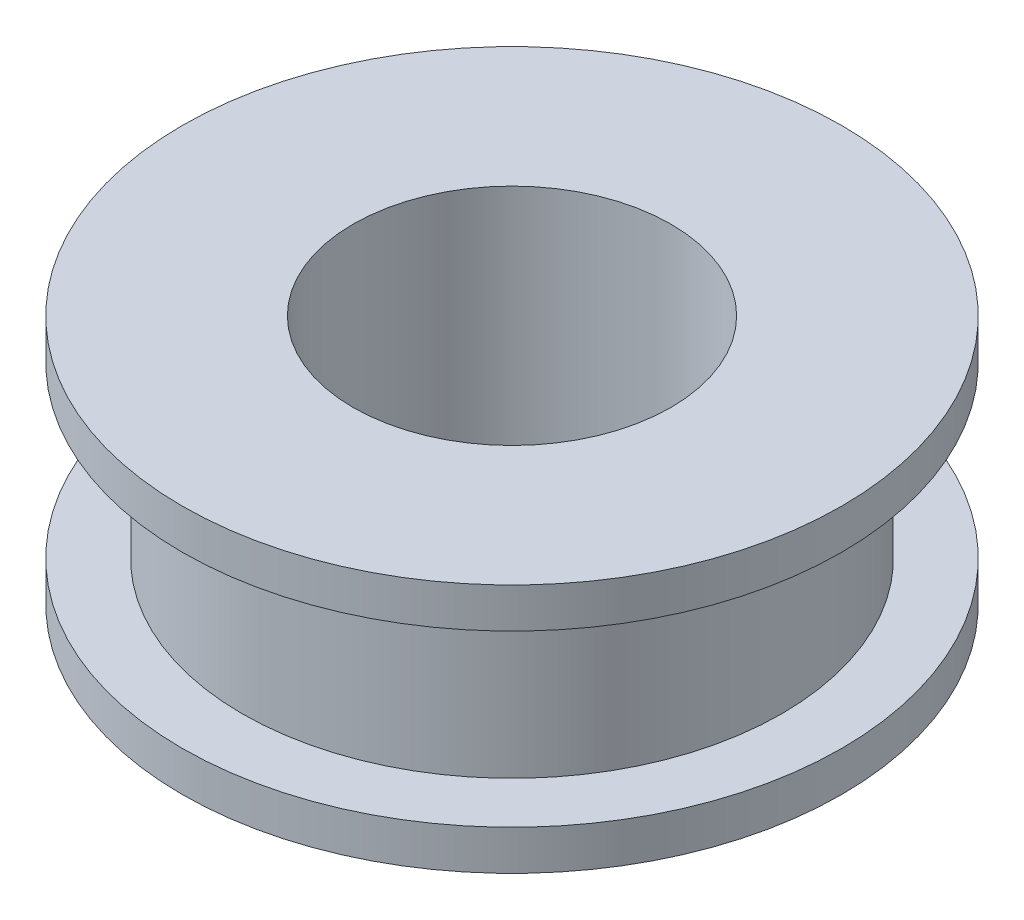
ISO-10303-21;
HEADER;
FILE_DESCRIPTION(('STEP AP214'),'2;1');
FILE_NAME('part.step','',(''),(''),'','','');
FILE_SCHEMA(('AUTOMOTIVE_DESIGN { 1 0 10303 214 1 1 1 1 }'));
ENDSEC;
DATA;
#1=APPLICATION_CONTEXT('core data for automotive mechanical design processes');
#2=APPLICATION_PROTOCOL_DEFINITION('international standard','automotive_design',2000,#1);
#3=PRODUCT_CONTEXT('',#1,'mechanical');
#4=PRODUCT('Part','Part','',(#3));
#5=PRODUCT_RELATED_PRODUCT_CATEGORY('part','',(#4));
#6=PRODUCT_DEFINITION_FORMATION('','',#4);
#7=PRODUCT_DEFINITION_CONTEXT('part definition',#1,'design');
#8=PRODUCT_DEFINITION('design','',#6,#7);
#9=PRODUCT_DEFINITION_SHAPE('','',#8);
#10=(LENGTH_UNIT() NAMED_UNIT(*) SI_UNIT(.MILLI.,.METRE.));
#11=(NAMED_UNIT(*) PLANE_ANGLE_UNIT() SI_UNIT($,.RADIAN.));
#12=(NAMED_UNIT(*) SI_UNIT($,.STERADIAN.) SOLID_ANGLE_UNIT());
#13=UNCERTAINTY_MEASURE_WITH_UNIT(LENGTH_MEASURE(1.E-05),#10,'distance_accuracy_value','');
#14=(GEOMETRIC_REPRESENTATION_CONTEXT(3) GLOBAL_UNCERTAINTY_ASSIGNED_CONTEXT((#13)) GLOBAL_UNIT_ASSIGNED_CONTEXT((#10,
#11,#12)) REPRESENTATION_CONTEXT('',''));
#15=CARTESIAN_POINT('',(0.,0.,0.));
#16=DIRECTION('',(0.,0.,1.));
#17=DIRECTION('',(1.,0.,0.));
#18=AXIS2_PLACEMENT_3D('',#15,#16,#17);
#19=CARTESIAN_POINT('',(0.,-6.24999999999999,0.));
#20=DIRECTION('',(0.,1.,0.));
#21=DIRECTION('',(0.,0.,1.));
#22=AXIS2_PLACEMENT_3D('',#19,#20,#21);
#23=PLANE('',#22);
#24=CARTESIAN_POINT('',(0.,-6.25,0.));
#25=DIRECTION('',(0.,1.,0.));
#26=DIRECTION('',(0.,0.,1.));
#27=AXIS2_PLACEMENT_3D('',#24,#25,#26);
#28=CIRCLE('',#27,16.5);
#29=CARTESIAN_POINT('',(0.,-6.25,16.5));
#30=VERTEX_POINT('',#29);
#31=EDGE_CURVE('E73',#30,#30,#28,.T.);
#32=ORIENTED_EDGE('',*,*,#31,.F.);
#33=EDGE_LOOP('',(#32));
#34=FACE_BOUND('',#33,.T.);
#35=CARTESIAN_POINT('',(0.,-6.24999999999999,0.));
#36=DIRECTION('',(0.,1.,0.));
#37=DIRECTION('',(0.,0.,1.));
#38=AXIS2_PLACEMENT_3D('',#35,#36,#37);
#39=CIRCLE('',#38,7.94999999999999);
#40=CARTESIAN_POINT('',(0.,-6.24999999999999,7.94999999999999));
#41=VERTEX_POINT('',#40);
#42=EDGE_CURVE('E10',#41,#41,#39,.T.);
#43=ORIENTED_EDGE('',*,*,#42,.T.);
#44=EDGE_LOOP('',(#43));
#45=FACE_BOUND('',#44,.T.);
#46=ADVANCED_FACE('F38',(#34,#45),#23,.F.);
#47=CARTESIAN_POINT('',(0.,35.1393680950893,0.));
#48=DIRECTION('',(0.,1.,0.));
#49=DIRECTION('',(0.,0.,1.));
#50=AXIS2_PLACEMENT_3D('',#47,#48,#49);
#51=CYLINDRICAL_SURFACE('',#50,7.94999999999999);
#52=ORIENTED_EDGE('',*,*,#42,.F.);
#53=EDGE_LOOP('',(#52));
#54=FACE_BOUND('',#53,.T.);
#55=CARTESIAN_POINT('',(0.,6.24999999999999,0.));
#56=DIRECTION('',(0.,1.,0.));
#57=DIRECTION('',(0.,0.,1.));
#58=AXIS2_PLACEMENT_3D('',#55,#56,#57);
#59=CIRCLE('',#58,7.94999999999999);
#60=CARTESIAN_POINT('',(0.,6.24999999999999,7.94999999999999));
#61=VERTEX_POINT('',#60);
#62=EDGE_CURVE('E45',#61,#61,#59,.T.);
#63=ORIENTED_EDGE('',*,*,#62,.T.);
#64=EDGE_LOOP('',(#63));
#65=FACE_BOUND('',#64,.T.);
#66=ADVANCED_FACE('F81',(#54,#65),#51,.F.);
#67=CARTESIAN_POINT('',(0.,6.24999999999999,0.));
#68=DIRECTION('',(0.,1.,0.));
#69=DIRECTION('',(0.,0.,1.));
#70=AXIS2_PLACEMENT_3D('',#67,#68,#69);
#71=PLANE('',#70);
#72=CARTESIAN_POINT('',(0.,6.24999999999999,0.));
#73=DIRECTION('',(0.,1.,0.));
#74=DIRECTION('',(0.,0.,1.));
#75=AXIS2_PLACEMENT_3D('',#72,#73,#74);
#76=CIRCLE('',#75,16.5);
#77=CARTESIAN_POINT('',(0.,6.24999999999999,16.5));
#78=VERTEX_POINT('',#77);
#79=EDGE_CURVE('E52',#78,#78,#76,.T.);
#80=ORIENTED_EDGE('',*,*,#79,.T.);
#81=EDGE_LOOP('',(#80));
#82=FACE_BOUND('',#81,.T.);
#83=ORIENTED_EDGE('',*,*,#62,.F.);
#84=EDGE_LOOP('',(#83));
#85=FACE_BOUND('',#84,.T.);
#86=ADVANCED_FACE('F85',(#82,#85),#71,.T.);
#87=CARTESIAN_POINT('',(0.,35.1393680950893,0.));
#88=DIRECTION('',(0.,1.,0.));
#89=DIRECTION('',(0.,0.,1.));
#90=AXIS2_PLACEMENT_3D('',#87,#88,#89);
#91=CYLINDRICAL_SURFACE('',#90,16.5);
#92=CARTESIAN_POINT('',(0.,4.24999999999999,0.));
#93=DIRECTION('',(0.,1.,0.));
#94=DIRECTION('',(0.,0.,1.));
#95=AXIS2_PLACEMENT_3D('',#92,#93,#94);
#96=CIRCLE('',#95,16.5);
#97=CARTESIAN_POINT('',(0.,4.24999999999999,16.5));
#98=VERTEX_POINT('',#97);
#99=EDGE_CURVE('E58',#98,#98,#96,.T.);
#100=ORIENTED_EDGE('',*,*,#99,.T.);
#101=EDGE_LOOP('',(#100));
#102=FACE_BOUND('',#101,.T.);
#103=ORIENTED_EDGE('',*,*,#79,.F.);
#104=EDGE_LOOP('',(#103));
#105=FACE_BOUND('',#104,.T.);
#106=ADVANCED_FACE('F90',(#102,#105),#91,.T.);
#107=CARTESIAN_POINT('',(0.,4.25,0.));
#108=DIRECTION('',(0.,-1.,0.));
#109=DIRECTION('',(0.,0.,-1.));
#110=AXIS2_PLACEMENT_3D('',#107,#108,#109);
#111=PLANE('',#110);
#112=CARTESIAN_POINT('',(0.,4.25,0.));
#113=DIRECTION('',(0.,1.,0.));
#114=DIRECTION('',(0.,0.,1.));
#115=AXIS2_PLACEMENT_3D('',#112,#113,#114);
#116=CIRCLE('',#115,13.5);
#117=CARTESIAN_POINT('',(0.,4.25,13.5));
#118=VERTEX_POINT('',#117);
#119=EDGE_CURVE('E64',#118,#118,#116,.T.);
#120=ORIENTED_EDGE('',*,*,#119,.T.);
#121=EDGE_LOOP('',(#120));
#122=FACE_BOUND('',#121,.T.);
#123=ORIENTED_EDGE('',*,*,#99,.F.);
#124=EDGE_LOOP('',(#123));
#125=FACE_BOUND('',#124,.T.);
#126=ADVANCED_FACE('F96',(#122,#125),#111,.T.);
#127=CARTESIAN_POINT('',(0.,35.1393680950893,0.));
#128=DIRECTION('',(0.,1.,0.));
#129=DIRECTION('',(0.,0.,1.));
#130=AXIS2_PLACEMENT_3D('',#127,#128,#129);
#131=CYLINDRICAL_SURFACE('',#130,13.5);
#132=CARTESIAN_POINT('',(0.,-4.25,0.));
#133=DIRECTION('',(0.,1.,0.));
#134=DIRECTION('',(0.,0.,1.));
#135=AXIS2_PLACEMENT_3D('',#132,#133,#134);
#136=CIRCLE('',#135,13.5);
#137=CARTESIAN_POINT('',(0.,-4.25,13.5));
#138=VERTEX_POINT('',#137);
#139=EDGE_CURVE('E67',#138,#138,#136,.T.);
#140=ORIENTED_EDGE('',*,*,#139,.T.);
#141=EDGE_LOOP('',(#140));
#142=FACE_BOUND('',#141,.T.);
#143=ORIENTED_EDGE('',*,*,#119,.F.);
#144=EDGE_LOOP('',(#143));
#145=FACE_BOUND('',#144,.T.);
#146=ADVANCED_FACE('F100',(#142,#145),#131,.T.);
#147=CARTESIAN_POINT('',(0.,-4.25,0.));
#148=DIRECTION('',(0.,-1.,0.));
#149=DIRECTION('',(0.,0.,-1.));
#150=AXIS2_PLACEMENT_3D('',#147,#148,#149);
#151=PLANE('',#150);
#152=ORIENTED_EDGE('',*,*,#139,.F.);
#153=EDGE_LOOP('',(#152));
#154=FACE_BOUND('',#153,.T.);
#155=CARTESIAN_POINT('',(0.,-4.25,0.));
#156=DIRECTION('',(0.,1.,0.));
#157=DIRECTION('',(0.,0.,1.));
#158=AXIS2_PLACEMENT_3D('',#155,#156,#157);
#159=CIRCLE('',#158,16.5);
#160=CARTESIAN_POINT('',(0.,-4.25,16.5));
#161=VERTEX_POINT('',#160);
#162=EDGE_CURVE('E70',#161,#161,#159,.T.);
#163=ORIENTED_EDGE('',*,*,#162,.T.);
#164=EDGE_LOOP('',(#163));
#165=FACE_BOUND('',#164,.T.);
#166=ADVANCED_FACE('F104',(#154,#165),#151,.F.);
#167=CARTESIAN_POINT('',(0.,35.1393680950893,0.));
#168=DIRECTION('',(0.,1.,0.));
#169=DIRECTION('',(0.,0.,1.));
#170=AXIS2_PLACEMENT_3D('',#167,#168,#169);
#171=CYLINDRICAL_SURFACE('',#170,16.5);
#172=ORIENTED_EDGE('',*,*,#162,.F.);
#173=EDGE_LOOP('',(#172));
#174=FACE_BOUND('',#173,.T.);
#175=ORIENTED_EDGE('',*,*,#31,.T.);
#176=EDGE_LOOP('',(#175));
#177=FACE_BOUND('',#176,.T.);
#178=ADVANCED_FACE('F78',(#174,#177),#171,.T.);
#179=CLOSED_SHELL('',(#46,#66,#86,#106,#126,#146,#166,#178));
#180=MANIFOLD_SOLID_BREP('B2',#179);
#181=ADVANCED_BREP_SHAPE_REPRESENTATION('',(#18,#180),#14);
#182=SHAPE_DEFINITION_REPRESENTATION(#9,#181);
ENDSEC;
END-ISO-10303-21;
